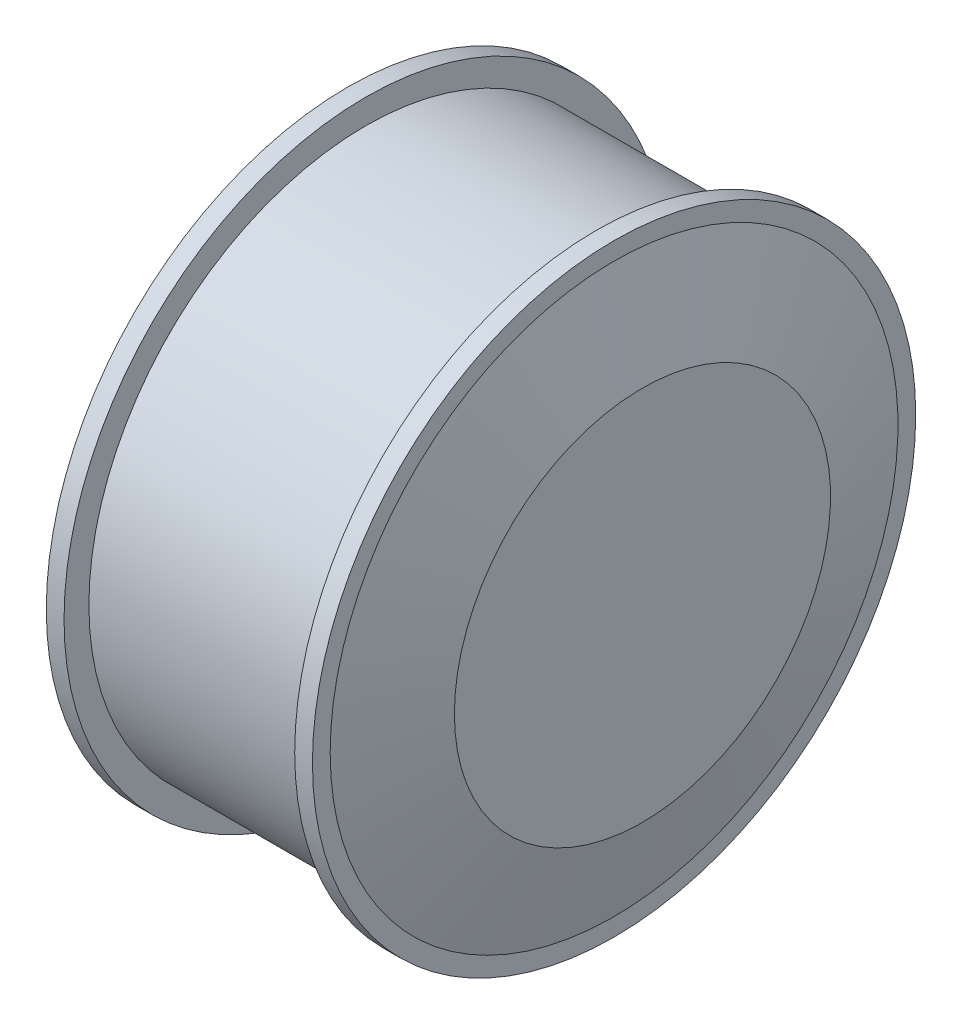
ISO-10303-21;
HEADER;
FILE_DESCRIPTION(('STEP AP214'),'2;1');
FILE_NAME('part.step','',(''),(''),'','','');
FILE_SCHEMA(('AUTOMOTIVE_DESIGN { 1 0 10303 214 1 1 1 1 }'));
ENDSEC;
DATA;
#1=APPLICATION_CONTEXT('core data for automotive mechanical design processes');
#2=APPLICATION_PROTOCOL_DEFINITION('international standard','automotive_design',2000,#1);
#3=PRODUCT_CONTEXT('',#1,'mechanical');
#4=PRODUCT('Part','Part','',(#3));
#5=PRODUCT_RELATED_PRODUCT_CATEGORY('part','',(#4));
#6=PRODUCT_DEFINITION_FORMATION('','',#4);
#7=PRODUCT_DEFINITION_CONTEXT('part definition',#1,'design');
#8=PRODUCT_DEFINITION('design','',#6,#7);
#9=PRODUCT_DEFINITION_SHAPE('','',#8);
#10=(LENGTH_UNIT() NAMED_UNIT(*) SI_UNIT(.MILLI.,.METRE.));
#11=(NAMED_UNIT(*) PLANE_ANGLE_UNIT() SI_UNIT($,.RADIAN.));
#12=(NAMED_UNIT(*) SI_UNIT($,.STERADIAN.) SOLID_ANGLE_UNIT());
#13=UNCERTAINTY_MEASURE_WITH_UNIT(LENGTH_MEASURE(1.E-05),#10,'distance_accuracy_value','');
#14=(GEOMETRIC_REPRESENTATION_CONTEXT(3) GLOBAL_UNCERTAINTY_ASSIGNED_CONTEXT((#13)) GLOBAL_UNIT_ASSIGNED_CONTEXT((#10,
#11,#12)) REPRESENTATION_CONTEXT('',''));
#15=CARTESIAN_POINT('',(0.,0.,0.));
#16=DIRECTION('',(0.,0.,1.));
#17=DIRECTION('',(1.,0.,0.));
#18=AXIS2_PLACEMENT_3D('',#15,#16,#17);
#19=CARTESIAN_POINT('',(-48.5000000000002,10.9999999999997,0.));
#20=DIRECTION('',(1.,0.,0.));
#21=DIRECTION('',(0.,0.,-1.));
#22=AXIS2_PLACEMENT_3D('',#19,#20,#21);
#23=PLANE('',#22);
#24=CARTESIAN_POINT('',(-48.5000000000002,0.,0.));
#25=DIRECTION('',(-1.,0.,0.));
#26=DIRECTION('',(0.,0.,1.));
#27=AXIS2_PLACEMENT_3D('',#24,#25,#26);
#28=CIRCLE('',#27,7.99999999999956);
#29=CARTESIAN_POINT('',(-48.5000000000002,0.,7.99999999999956));
#30=VERTEX_POINT('',#29);
#31=EDGE_CURVE('E96',#30,#30,#28,.T.);
#32=ORIENTED_EDGE('',*,*,#31,.F.);
#33=EDGE_LOOP('',(#32));
#34=FACE_BOUND('',#33,.T.);
#35=CARTESIAN_POINT('',(-48.5000000000002,0.,0.));
#36=DIRECTION('',(-1.,0.,0.));
#37=DIRECTION('',(0.,0.,1.));
#38=AXIS2_PLACEMENT_3D('',#35,#36,#37);
#39=CIRCLE('',#38,10.9999999999997);
#40=CARTESIAN_POINT('',(-48.5000000000002,0.,10.9999999999997));
#41=VERTEX_POINT('',#40);
#42=EDGE_CURVE('E137',#41,#41,#39,.T.);
#43=ORIENTED_EDGE('',*,*,#42,.T.);
#44=EDGE_LOOP('',(#43));
#45=FACE_BOUND('',#44,.T.);
#46=ADVANCED_FACE('F40',(#34,#45),#23,.F.);
#47=CARTESIAN_POINT('',(-1100.90367486449,0.,0.));
#48=DIRECTION('',(-1.,0.,0.));
#49=DIRECTION('',(0.,0.,1.));
#50=AXIS2_PLACEMENT_3D('',#47,#48,#49);
#51=CYLINDRICAL_SURFACE('',#50,10.9999999999997);
#52=ORIENTED_EDGE('',*,*,#42,.F.);
#53=EDGE_LOOP('',(#52));
#54=FACE_BOUND('',#53,.T.);
#55=CARTESIAN_POINT('',(-45.5000000000001,0.,0.));
#56=DIRECTION('',(-1.,0.,0.));
#57=DIRECTION('',(0.,0.,1.));
#58=AXIS2_PLACEMENT_3D('',#55,#56,#57);
#59=CIRCLE('',#58,10.9999999999997);
#60=CARTESIAN_POINT('',(-45.5000000000001,0.,10.9999999999997));
#61=VERTEX_POINT('',#60);
#62=EDGE_CURVE('E135',#61,#61,#59,.T.);
#63=ORIENTED_EDGE('',*,*,#62,.T.);
#64=EDGE_LOOP('',(#63));
#65=FACE_BOUND('',#64,.T.);
#66=ADVANCED_FACE('F165',(#54,#65),#51,.T.);
#67=CARTESIAN_POINT('',(-45.5000000000003,52.9999999999996,0.));
#68=DIRECTION('',(1.,0.,0.));
#69=DIRECTION('',(0.,0.,-1.));
#70=AXIS2_PLACEMENT_3D('',#67,#68,#69);
#71=PLANE('',#70);
#72=ORIENTED_EDGE('',*,*,#62,.F.);
#73=EDGE_LOOP('',(#72));
#74=FACE_BOUND('',#73,.T.);
#75=CARTESIAN_POINT('',(-45.5000000000005,0.,0.));
#76=DIRECTION('',(-1.,0.,0.));
#77=DIRECTION('',(0.,0.,1.));
#78=AXIS2_PLACEMENT_3D('',#75,#76,#77);
#79=CIRCLE('',#78,52.9999999999996);
#80=CARTESIAN_POINT('',(-45.5000000000005,0.,52.9999999999996));
#81=VERTEX_POINT('',#80);
#82=EDGE_CURVE('E132',#81,#81,#79,.T.);
#83=ORIENTED_EDGE('',*,*,#82,.T.);
#84=EDGE_LOOP('',(#83));
#85=FACE_BOUND('',#84,.T.);
#86=ADVANCED_FACE('F170',(#74,#85),#71,.F.);
#87=CARTESIAN_POINT('',(-37.5000000000005,0.,0.));
#88=DIRECTION('',(1.,0.,0.));
#89=DIRECTION('',(0.,0.,-1.));
#90=AXIS2_PLACEMENT_3D('',#87,#88,#89);
#91=CONICAL_SURFACE('',#90,79.9999999999996,1.28274087974427);
#92=ORIENTED_EDGE('',*,*,#82,.F.);
#93=EDGE_LOOP('',(#92));
#94=FACE_BOUND('',#93,.T.);
#95=CARTESIAN_POINT('',(-37.5000000000005,0.,0.));
#96=DIRECTION('',(-1.,0.,0.));
#97=DIRECTION('',(0.,0.,1.));
#98=AXIS2_PLACEMENT_3D('',#95,#96,#97);
#99=CIRCLE('',#98,79.9999999999996);
#100=CARTESIAN_POINT('',(-37.5000000000005,0.,79.9999999999996));
#101=VERTEX_POINT('',#100);
#102=EDGE_CURVE('E129',#101,#101,#99,.T.);
#103=ORIENTED_EDGE('',*,*,#102,.T.);
#104=EDGE_LOOP('',(#103));
#105=FACE_BOUND('',#104,.T.);
#106=ADVANCED_FACE('F176',(#94,#105),#91,.T.);
#107=CARTESIAN_POINT('',(-37.5000000000006,84.9999999999996,0.));
#108=DIRECTION('',(1.,0.,0.));
#109=DIRECTION('',(0.,0.,-1.));
#110=AXIS2_PLACEMENT_3D('',#107,#108,#109);
#111=PLANE('',#110);
#112=ORIENTED_EDGE('',*,*,#102,.F.);
#113=EDGE_LOOP('',(#112));
#114=FACE_BOUND('',#113,.T.);
#115=CARTESIAN_POINT('',(-37.5000000000005,0.,0.));
#116=DIRECTION('',(-1.,0.,0.));
#117=DIRECTION('',(0.,0.,1.));
#118=AXIS2_PLACEMENT_3D('',#115,#116,#117);
#119=CIRCLE('',#118,84.9999999999996);
#120=CARTESIAN_POINT('',(-37.5000000000005,0.,84.9999999999996));
#121=VERTEX_POINT('',#120);
#122=EDGE_CURVE('E126',#121,#121,#119,.T.);
#123=ORIENTED_EDGE('',*,*,#122,.T.);
#124=EDGE_LOOP('',(#123));
#125=FACE_BOUND('',#124,.T.);
#126=ADVANCED_FACE('F183',(#114,#125),#111,.F.);
#127=CARTESIAN_POINT('',(-1100.90367486449,0.,0.));
#128=DIRECTION('',(-1.,0.,0.));
#129=DIRECTION('',(0.,0.,1.));
#130=AXIS2_PLACEMENT_3D('',#127,#128,#129);
#131=CYLINDRICAL_SURFACE('',#130,84.9999999999996);
#132=ORIENTED_EDGE('',*,*,#122,.F.);
#133=EDGE_LOOP('',(#132));
#134=FACE_BOUND('',#133,.T.);
#135=CARTESIAN_POINT('',(-32.5000000000006,0.,0.));
#136=DIRECTION('',(-1.,0.,0.));
#137=DIRECTION('',(0.,0.,1.));
#138=AXIS2_PLACEMENT_3D('',#135,#136,#137);
#139=CIRCLE('',#138,84.9999999999996);
#140=CARTESIAN_POINT('',(-32.5000000000006,0.,84.9999999999996));
#141=VERTEX_POINT('',#140);
#142=EDGE_CURVE('E123',#141,#141,#139,.T.);
#143=ORIENTED_EDGE('',*,*,#142,.T.);
#144=EDGE_LOOP('',(#143));
#145=FACE_BOUND('',#144,.T.);
#146=ADVANCED_FACE('F187',(#134,#145),#131,.T.);
#147=CARTESIAN_POINT('',(-32.5000000000003,84.9999999999996,0.));
#148=DIRECTION('',(-1.,0.,0.));
#149=DIRECTION('',(0.,0.,1.));
#150=AXIS2_PLACEMENT_3D('',#147,#148,#149);
#151=PLANE('',#150);
#152=ORIENTED_EDGE('',*,*,#142,.F.);
#153=EDGE_LOOP('',(#152));
#154=FACE_BOUND('',#153,.T.);
#155=CARTESIAN_POINT('',(-32.5,0.,0.));
#156=DIRECTION('',(-1.,0.,0.));
#157=DIRECTION('',(0.,0.,1.));
#158=AXIS2_PLACEMENT_3D('',#155,#156,#157);
#159=CIRCLE('',#158,78.);
#160=CARTESIAN_POINT('',(-32.5,0.,78.));
#161=VERTEX_POINT('',#160);
#162=EDGE_CURVE('E120',#161,#161,#159,.T.);
#163=ORIENTED_EDGE('',*,*,#162,.T.);
#164=EDGE_LOOP('',(#163));
#165=FACE_BOUND('',#164,.T.);
#166=ADVANCED_FACE('F191',(#154,#165),#151,.F.);
#167=CARTESIAN_POINT('',(-1100.90367486449,0.,0.));
#168=DIRECTION('',(-1.,0.,0.));
#169=DIRECTION('',(0.,0.,1.));
#170=AXIS2_PLACEMENT_3D('',#167,#168,#169);
#171=CYLINDRICAL_SURFACE('',#170,78.);
#172=ORIENTED_EDGE('',*,*,#162,.F.);
#173=EDGE_LOOP('',(#172));
#174=FACE_BOUND('',#173,.T.);
#175=CARTESIAN_POINT('',(32.5,0.,0.));
#176=DIRECTION('',(-1.,0.,0.));
#177=DIRECTION('',(0.,0.,1.));
#178=AXIS2_PLACEMENT_3D('',#175,#176,#177);
#179=CIRCLE('',#178,78.);
#180=CARTESIAN_POINT('',(32.5,0.,78.));
#181=VERTEX_POINT('',#180);
#182=EDGE_CURVE('E117',#181,#181,#179,.T.);
#183=ORIENTED_EDGE('',*,*,#182,.T.);
#184=EDGE_LOOP('',(#183));
#185=FACE_BOUND('',#184,.T.);
#186=ADVANCED_FACE('F195',(#174,#185),#171,.T.);
#187=CARTESIAN_POINT('',(32.5,78.,0.));
#188=DIRECTION('',(1.,0.,0.));
#189=DIRECTION('',(0.,0.,-1.));
#190=AXIS2_PLACEMENT_3D('',#187,#188,#189);
#191=PLANE('',#190);
#192=ORIENTED_EDGE('',*,*,#182,.F.);
#193=EDGE_LOOP('',(#192));
#194=FACE_BOUND('',#193,.T.);
#195=CARTESIAN_POINT('',(32.5,0.,0.));
#196=DIRECTION('',(-1.,0.,0.));
#197=DIRECTION('',(0.,0.,1.));
#198=AXIS2_PLACEMENT_3D('',#195,#196,#197);
#199=CIRCLE('',#198,85.);
#200=CARTESIAN_POINT('',(32.5,0.,85.));
#201=VERTEX_POINT('',#200);
#202=EDGE_CURVE('E114',#201,#201,#199,.T.);
#203=ORIENTED_EDGE('',*,*,#202,.T.);
#204=EDGE_LOOP('',(#203));
#205=FACE_BOUND('',#204,.T.);
#206=ADVANCED_FACE('F199',(#194,#205),#191,.F.);
#207=CARTESIAN_POINT('',(-1100.90367486449,0.,0.));
#208=DIRECTION('',(-1.,0.,0.));
#209=DIRECTION('',(0.,0.,1.));
#210=AXIS2_PLACEMENT_3D('',#207,#208,#209);
#211=CYLINDRICAL_SURFACE('',#210,85.);
#212=ORIENTED_EDGE('',*,*,#202,.F.);
#213=EDGE_LOOP('',(#212));
#214=FACE_BOUND('',#213,.T.);
#215=CARTESIAN_POINT('',(37.5000000000001,0.,0.));
#216=DIRECTION('',(-1.,0.,0.));
#217=DIRECTION('',(0.,0.,1.));
#218=AXIS2_PLACEMENT_3D('',#215,#216,#217);
#219=CIRCLE('',#218,85.);
#220=CARTESIAN_POINT('',(37.5000000000001,0.,85.));
#221=VERTEX_POINT('',#220);
#222=EDGE_CURVE('E111',#221,#221,#219,.T.);
#223=ORIENTED_EDGE('',*,*,#222,.T.);
#224=EDGE_LOOP('',(#223));
#225=FACE_BOUND('',#224,.T.);
#226=ADVANCED_FACE('F203',(#214,#225),#211,.T.);
#227=CARTESIAN_POINT('',(37.5,85.,0.));
#228=DIRECTION('',(-1.,0.,0.));
#229=DIRECTION('',(0.,0.,1.));
#230=AXIS2_PLACEMENT_3D('',#227,#228,#229);
#231=PLANE('',#230);
#232=ORIENTED_EDGE('',*,*,#222,.F.);
#233=EDGE_LOOP('',(#232));
#234=FACE_BOUND('',#233,.T.);
#235=CARTESIAN_POINT('',(37.5000000000001,0.,0.));
#236=DIRECTION('',(-1.,0.,0.));
#237=DIRECTION('',(0.,0.,1.));
#238=AXIS2_PLACEMENT_3D('',#235,#236,#237);
#239=CIRCLE('',#238,80.);
#240=CARTESIAN_POINT('',(37.5000000000001,0.,80.));
#241=VERTEX_POINT('',#240);
#242=EDGE_CURVE('E108',#241,#241,#239,.T.);
#243=ORIENTED_EDGE('',*,*,#242,.T.);
#244=EDGE_LOOP('',(#243));
#245=FACE_BOUND('',#244,.T.);
#246=ADVANCED_FACE('F207',(#234,#245),#231,.F.);
#247=CARTESIAN_POINT('',(45.5000000000001,0.,0.));
#248=DIRECTION('',(-1.,0.,0.));
#249=DIRECTION('',(0.,0.,1.));
#250=AXIS2_PLACEMENT_3D('',#247,#248,#249);
#251=CONICAL_SURFACE('',#250,53.,1.28274087974427);
#252=ORIENTED_EDGE('',*,*,#242,.F.);
#253=EDGE_LOOP('',(#252));
#254=FACE_BOUND('',#253,.T.);
#255=CARTESIAN_POINT('',(45.5000000000001,0.,0.));
#256=DIRECTION('',(-1.,0.,0.));
#257=DIRECTION('',(0.,0.,1.));
#258=AXIS2_PLACEMENT_3D('',#255,#256,#257);
#259=CIRCLE('',#258,53.);
#260=CARTESIAN_POINT('',(45.5000000000001,0.,53.));
#261=VERTEX_POINT('',#260);
#262=EDGE_CURVE('E102',#261,#261,#259,.T.);
#263=ORIENTED_EDGE('',*,*,#262,.T.);
#264=EDGE_LOOP('',(#263));
#265=FACE_BOUND('',#264,.T.);
#266=ADVANCED_FACE('F211',(#254,#265),#251,.T.);
#267=CARTESIAN_POINT('',(45.5000000000001,53.,0.));
#268=DIRECTION('',(-1.,0.,0.));
#269=DIRECTION('',(0.,0.,1.));
#270=AXIS2_PLACEMENT_3D('',#267,#268,#269);
#271=PLANE('',#270);
#272=ORIENTED_EDGE('',*,*,#262,.F.);
#273=EDGE_LOOP('',(#272));
#274=FACE_BOUND('',#273,.T.);
#275=ADVANCED_FACE('F215',(#274),#271,.F.);
#276=CARTESIAN_POINT('',(-87.5000000000001,7.99999999999956,0.));
#277=DIRECTION('',(1.,0.,0.));
#278=DIRECTION('',(0.,0.,-1.));
#279=AXIS2_PLACEMENT_3D('',#276,#277,#278);
#280=PLANE('',#279);
#281=CARTESIAN_POINT('',(-87.5000000000001,0.,0.));
#282=DIRECTION('',(-1.,0.,0.));
#283=DIRECTION('',(0.,0.,1.));
#284=AXIS2_PLACEMENT_3D('',#281,#282,#283);
#285=CIRCLE('',#284,7.99999999999956);
#286=CARTESIAN_POINT('',(-87.5000000000001,-5.29150262212852,-5.99999999997181));
#287=VERTEX_POINT('',#286);
#288=CARTESIAN_POINT('',(-87.5000000000001,-5.29150262212852,5.99999999997181));
#289=VERTEX_POINT('',#288);
#290=EDGE_CURVE('E95',#287,#289,#285,.T.);
#291=ORIENTED_EDGE('',*,*,#290,.T.);
#292=DIRECTION('',(0.,1.,0.));
#293=VECTOR('',#292,1.);
#294=CARTESIAN_POINT('',(-87.5000000000001,-291587.9,5.99999999997181));
#295=LINE('',#294,#293);
#296=CARTESIAN_POINT('',(-87.5000000000001,5.2915026221428,5.99999999998799));
#297=VERTEX_POINT('',#296);
#298=EDGE_CURVE('E78',#289,#297,#295,.T.);
#299=ORIENTED_EDGE('',*,*,#298,.T.);
#300=CARTESIAN_POINT('',(-87.5000000000001,5.29150262212852,-5.99999999997181));
#301=VERTEX_POINT('',#300);
#302=EDGE_CURVE('E100',#297,#301,#285,.T.);
#303=ORIENTED_EDGE('',*,*,#302,.T.);
#304=DIRECTION('',(0.,-1.,0.));
#305=VECTOR('',#304,1.);
#306=CARTESIAN_POINT('',(-87.5000000000001,-291587.9,-5.99999999997181));
#307=LINE('',#306,#305);
#308=EDGE_CURVE('E88',#301,#287,#307,.T.);
#309=ORIENTED_EDGE('',*,*,#308,.T.);
#310=EDGE_LOOP('',(#291,#299,#303,#309));
#311=FACE_BOUND('',#310,.T.);
#312=ADVANCED_FACE('F99',(#311),#280,.F.);
#313=CARTESIAN_POINT('',(-1100.90367486449,0.,0.));
#314=DIRECTION('',(-1.,0.,0.));
#315=DIRECTION('',(0.,0.,1.));
#316=AXIS2_PLACEMENT_3D('',#313,#314,#315);
#317=CYLINDRICAL_SURFACE('',#316,7.99999999999956);
#318=DIRECTION('',(1.,0.,0.));
#319=VECTOR('',#318,1.);
#320=CARTESIAN_POINT('',(-87.5000000000001,5.2915026221428,5.99999999998799));
#321=LINE('',#320,#319);
#322=CARTESIAN_POINT('',(-53.5000000000001,5.29150262216048,5.99999999997181));
#323=VERTEX_POINT('',#322);
#324=EDGE_CURVE('E83',#297,#323,#321,.T.);
#325=ORIENTED_EDGE('',*,*,#324,.T.);
#326=CARTESIAN_POINT('',(-53.5000000000001,0.,0.));
#327=DIRECTION('',(1.,0.,0.));
#328=DIRECTION('',(0.,0.,-1.));
#329=AXIS2_PLACEMENT_3D('',#326,#327,#328);
#330=CIRCLE('',#329,7.99999999999956);
#331=CARTESIAN_POINT('',(-53.5000000000002,-5.29150262212852,5.99999999997181));
#332=VERTEX_POINT('',#331);
#333=EDGE_CURVE('E12',#323,#332,#330,.T.);
#334=ORIENTED_EDGE('',*,*,#333,.T.);
#335=DIRECTION('',(1.,0.,0.));
#336=VECTOR('',#335,1.);
#337=CARTESIAN_POINT('',(-87.5000000000001,-5.29150262212852,5.99999999997181));
#338=LINE('',#337,#336);
#339=EDGE_CURVE('E81',#289,#332,#338,.T.);
#340=ORIENTED_EDGE('',*,*,#339,.F.);
#341=ORIENTED_EDGE('',*,*,#290,.F.);
#342=DIRECTION('',(1.,0.,0.));
#343=VECTOR('',#342,1.);
#344=CARTESIAN_POINT('',(-87.5000000000001,-5.29150262212852,-5.99999999997181));
#345=LINE('',#344,#343);
#346=CARTESIAN_POINT('',(-53.5000000000001,-5.29150262216048,-5.99999999997181));
#347=VERTEX_POINT('',#346);
#348=EDGE_CURVE('E144',#287,#347,#345,.T.);
#349=ORIENTED_EDGE('',*,*,#348,.T.);
#350=CARTESIAN_POINT('',(-53.5000000000002,5.29150262212852,-5.99999999997181));
#351=VERTEX_POINT('',#350);
#352=EDGE_CURVE('E43',#347,#351,#330,.T.);
#353=ORIENTED_EDGE('',*,*,#352,.T.);
#354=DIRECTION('',(1.,0.,0.));
#355=VECTOR('',#354,1.);
#356=CARTESIAN_POINT('',(-87.5000000000001,5.29150262212852,-5.99999999997181));
#357=LINE('',#356,#355);
#358=EDGE_CURVE('E143',#301,#351,#357,.T.);
#359=ORIENTED_EDGE('',*,*,#358,.F.);
#360=ORIENTED_EDGE('',*,*,#302,.F.);
#361=EDGE_LOOP('',(#325,#334,#340,#341,#349,#353,#359,#360));
#362=FACE_BOUND('',#361,.T.);
#363=ORIENTED_EDGE('',*,*,#31,.T.);
#364=EDGE_LOOP('',(#363));
#365=FACE_BOUND('',#364,.T.);
#366=ADVANCED_FACE('F92',(#362,#365),#317,.T.);
#367=CARTESIAN_POINT('',(-87.5000000000001,-291587.9,-5.99999999997181));
#368=DIRECTION('',(0.,0.,1.));
#369=DIRECTION('',(1.,0.,0.));
#370=AXIS2_PLACEMENT_3D('',#367,#368,#369);
#371=PLANE('',#370);
#372=DIRECTION('',(0.,-1.,0.));
#373=VECTOR('',#372,1.);
#374=CARTESIAN_POINT('',(-53.5000000000002,-291587.9,-5.99999999997181));
#375=LINE('',#374,#373);
#376=EDGE_CURVE('E62',#351,#347,#375,.T.);
#377=ORIENTED_EDGE('',*,*,#376,.T.);
#378=ORIENTED_EDGE('',*,*,#348,.F.);
#379=ORIENTED_EDGE('',*,*,#308,.F.);
#380=ORIENTED_EDGE('',*,*,#358,.T.);
#381=EDGE_LOOP('',(#377,#378,#379,#380));
#382=FACE_BOUND('',#381,.T.);
#383=ADVANCED_FACE('F153',(#382),#371,.F.);
#384=CARTESIAN_POINT('',(-53.5000000000002,0.,0.));
#385=DIRECTION('',(1.,0.,0.));
#386=DIRECTION('',(0.,0.,-1.));
#387=AXIS2_PLACEMENT_3D('',#384,#385,#386);
#388=PLANE('',#387);
#389=ORIENTED_EDGE('',*,*,#376,.F.);
#390=ORIENTED_EDGE('',*,*,#352,.F.);
#391=EDGE_LOOP('',(#389,#390));
#392=FACE_BOUND('',#391,.T.);
#393=ADVANCED_FACE('F146',(#392),#388,.F.);
#394=DIRECTION('',(0.,1.,0.));
#395=VECTOR('',#394,1.);
#396=CARTESIAN_POINT('',(-53.5000000000002,-291587.9,5.99999999997181));
#397=LINE('',#396,#395);
#398=EDGE_CURVE('E54',#332,#323,#397,.T.);
#399=ORIENTED_EDGE('',*,*,#398,.F.);
#400=ORIENTED_EDGE('',*,*,#333,.F.);
#401=EDGE_LOOP('',(#399,#400));
#402=FACE_BOUND('',#401,.T.);
#403=ADVANCED_FACE('F160',(#402),#388,.F.);
#404=CARTESIAN_POINT('',(-87.5000000000001,-291587.9,5.99999999997181));
#405=DIRECTION('',(0.,0.,-1.));
#406=DIRECTION('',(-1.,0.,0.));
#407=AXIS2_PLACEMENT_3D('',#404,#405,#406);
#408=PLANE('',#407);
#409=ORIENTED_EDGE('',*,*,#398,.T.);
#410=ORIENTED_EDGE('',*,*,#324,.F.);
#411=ORIENTED_EDGE('',*,*,#298,.F.);
#412=ORIENTED_EDGE('',*,*,#339,.T.);
#413=EDGE_LOOP('',(#409,#410,#411,#412));
#414=FACE_BOUND('',#413,.T.);
#415=ADVANCED_FACE('F80',(#414),#408,.F.);
#416=CLOSED_SHELL('',(#46,#66,#86,#106,#126,#146,#166,#186,#206,#226,#246,#266,#275,#312,#366,
#383,#393,#403,#415));
#417=MANIFOLD_SOLID_BREP('B2',#416);
#418=ADVANCED_BREP_SHAPE_REPRESENTATION('',(#18,#417),#14);
#419=SHAPE_DEFINITION_REPRESENTATION(#9,#418);
ENDSEC;
END-ISO-10303-21;
